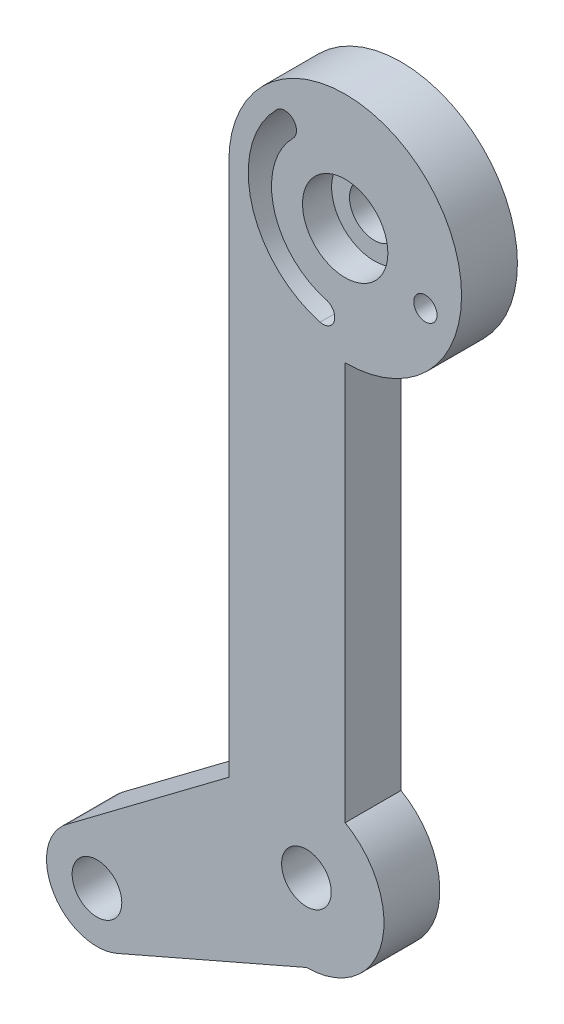
ISO-10303-21;
HEADER;
FILE_DESCRIPTION(('STEP AP214'),'2;1');
FILE_NAME('part.step','',(''),(''),'','','');
FILE_SCHEMA(('AUTOMOTIVE_DESIGN { 1 0 10303 214 1 1 1 1 }'));
ENDSEC;
DATA;
#1=APPLICATION_CONTEXT('core data for automotive mechanical design processes');
#2=APPLICATION_PROTOCOL_DEFINITION('international standard','automotive_design',2000,#1);
#3=PRODUCT_CONTEXT('',#1,'mechanical');
#4=PRODUCT('Part','Part','',(#3));
#5=PRODUCT_RELATED_PRODUCT_CATEGORY('part','',(#4));
#6=PRODUCT_DEFINITION_FORMATION('','',#4);
#7=PRODUCT_DEFINITION_CONTEXT('part definition',#1,'design');
#8=PRODUCT_DEFINITION('design','',#6,#7);
#9=PRODUCT_DEFINITION_SHAPE('','',#8);
#10=(LENGTH_UNIT() NAMED_UNIT(*) SI_UNIT(.MILLI.,.METRE.));
#11=(NAMED_UNIT(*) PLANE_ANGLE_UNIT() SI_UNIT($,.RADIAN.));
#12=(NAMED_UNIT(*) SI_UNIT($,.STERADIAN.) SOLID_ANGLE_UNIT());
#13=UNCERTAINTY_MEASURE_WITH_UNIT(LENGTH_MEASURE(1.E-05),#10,'distance_accuracy_value','');
#14=(GEOMETRIC_REPRESENTATION_CONTEXT(3) GLOBAL_UNCERTAINTY_ASSIGNED_CONTEXT((#13)) GLOBAL_UNIT_ASSIGNED_CONTEXT((#10,
#11,#12)) REPRESENTATION_CONTEXT('',''));
#15=CARTESIAN_POINT('',(0.,0.,0.));
#16=DIRECTION('',(0.,0.,1.));
#17=DIRECTION('',(1.,0.,0.));
#18=AXIS2_PLACEMENT_3D('',#15,#16,#17);
#19=CARTESIAN_POINT('',(2.5,37.5,3.6));
#20=DIRECTION('',(0.,0.,-1.));
#21=DIRECTION('',(-1.,0.,0.));
#22=AXIS2_PLACEMENT_3D('',#19,#20,#21);
#23=CYLINDRICAL_SURFACE('',#22,1.6);
#24=CARTESIAN_POINT('',(2.5,37.5,0.));
#25=DIRECTION('',(0.,0.,1.));
#26=DIRECTION('',(1.,0.,0.));
#27=AXIS2_PLACEMENT_3D('',#24,#25,#26);
#28=CIRCLE('',#27,1.6);
#29=CARTESIAN_POINT('',(4.09999999999999,37.5,0.));
#30=VERTEX_POINT('',#29);
#31=EDGE_CURVE('E177',#30,#30,#28,.T.);
#32=ORIENTED_EDGE('',*,*,#31,.F.);
#33=EDGE_LOOP('',(#32));
#34=FACE_BOUND('',#33,.T.);
#35=CARTESIAN_POINT('',(2.5,37.5,1.725));
#36=DIRECTION('',(0.,0.,1.));
#37=DIRECTION('',(1.,0.,0.));
#38=AXIS2_PLACEMENT_3D('',#35,#36,#37);
#39=CIRCLE('',#38,1.6);
#40=CARTESIAN_POINT('',(4.09999999999999,37.5,1.725));
#41=VERTEX_POINT('',#40);
#42=EDGE_CURVE('E49',#41,#41,#39,.T.);
#43=ORIENTED_EDGE('',*,*,#42,.T.);
#44=EDGE_LOOP('',(#43));
#45=FACE_BOUND('',#44,.T.);
#46=ADVANCED_FACE('F45',(#34,#45),#23,.F.);
#47=CARTESIAN_POINT('',(2.5,37.5,3.6));
#48=DIRECTION('',(0.,0.,1.));
#49=DIRECTION('',(1.,0.,0.));
#50=AXIS2_PLACEMENT_3D('',#47,#48,#49);
#51=PLANE('',#50);
#52=CARTESIAN_POINT('',(2.5,37.5,3.6));
#53=DIRECTION('',(0.,0.,1.));
#54=DIRECTION('',(1.,0.,0.));
#55=AXIS2_PLACEMENT_3D('',#52,#53,#54);
#56=CIRCLE('',#55,2.75);
#57=CARTESIAN_POINT('',(5.25,37.5,3.6));
#58=VERTEX_POINT('',#57);
#59=EDGE_CURVE('E158',#58,#58,#56,.T.);
#60=ORIENTED_EDGE('',*,*,#59,.F.);
#61=EDGE_LOOP('',(#60));
#62=FACE_BOUND('',#61,.T.);
#63=CARTESIAN_POINT('',(2.5,37.5,3.6));
#64=DIRECTION('',(0.,0.,1.));
#65=DIRECTION('',(1.,0.,0.));
#66=AXIS2_PLACEMENT_3D('',#63,#64,#65);
#67=CIRCLE('',#66,6.25);
#68=CARTESIAN_POINT('',(-1.91941738241593,41.9194173824159,3.6));
#69=VERTEX_POINT('',#68);
#70=CARTESIAN_POINT('',(0.882380968109289,31.4629635856933,3.6));
#71=VERTEX_POINT('',#70);
#72=EDGE_CURVE('E62',#69,#71,#67,.T.);
#73=ORIENTED_EDGE('',*,*,#72,.F.);
#74=CARTESIAN_POINT('',(-1.38908729652602,41.389087296526,3.6));
#75=DIRECTION('',(0.,0.,1.));
#76=DIRECTION('',(1.,0.,0.));
#77=AXIS2_PLACEMENT_3D('',#74,#75,#76);
#78=CIRCLE('',#77,0.749999999999998);
#79=CARTESIAN_POINT('',(-0.858757210636112,40.8587572106361,3.6));
#80=VERTEX_POINT('',#79);
#81=EDGE_CURVE('E151',#80,#69,#78,.T.);
#82=ORIENTED_EDGE('',*,*,#81,.F.);
#83=CARTESIAN_POINT('',(2.5,37.5,3.6));
#84=DIRECTION('',(0.,0.,-1.));
#85=DIRECTION('',(1.,0.,0.));
#86=AXIS2_PLACEMENT_3D('',#83,#84,#85);
#87=CIRCLE('',#86,4.75);
#88=CARTESIAN_POINT('',(1.27060953576306,32.9118523251269,3.6));
#89=VERTEX_POINT('',#88);
#90=EDGE_CURVE('E155',#89,#80,#87,.T.);
#91=ORIENTED_EDGE('',*,*,#90,.F.);
#92=CARTESIAN_POINT('',(1.07649525193617,32.1874079554101,3.6));
#93=DIRECTION('',(0.,0.,1.));
#94=DIRECTION('',(1.,0.,0.));
#95=AXIS2_PLACEMENT_3D('',#92,#93,#94);
#96=CIRCLE('',#95,0.749999999999997);
#97=EDGE_CURVE('E167',#71,#89,#96,.T.);
#98=ORIENTED_EDGE('',*,*,#97,.F.);
#99=EDGE_LOOP('',(#73,#82,#91,#98));
#100=FACE_BOUND('',#99,.T.);
#101=CARTESIAN_POINT('',(7.66830941432249,35.6188892117088,3.6));
#102=DIRECTION('',(0.,0.,1.));
#103=DIRECTION('',(1.,0.,0.));
#104=AXIS2_PLACEMENT_3D('',#101,#102,#103);
#105=CIRCLE('',#104,0.749999999999998);
#106=CARTESIAN_POINT('',(8.41830941432249,35.6188892117088,3.6));
#107=VERTEX_POINT('',#106);
#108=EDGE_CURVE('E186',#107,#107,#105,.T.);
#109=ORIENTED_EDGE('',*,*,#108,.F.);
#110=EDGE_LOOP('',(#109));
#111=FACE_BOUND('',#110,.T.);
#112=CARTESIAN_POINT('',(-13.5,-7.33557540571723,3.6));
#113=DIRECTION('',(0.,0.,1.));
#114=DIRECTION('',(1.,0.,0.));
#115=AXIS2_PLACEMENT_3D('',#112,#113,#114);
#116=CIRCLE('',#115,1.6);
#117=CARTESIAN_POINT('',(-11.9,-7.33557540571723,3.6));
#118=VERTEX_POINT('',#117);
#119=EDGE_CURVE('E194',#118,#118,#116,.T.);
#120=ORIENTED_EDGE('',*,*,#119,.F.);
#121=EDGE_LOOP('',(#120));
#122=FACE_BOUND('',#121,.T.);
#123=CARTESIAN_POINT('',(2.5,37.5,3.6));
#124=DIRECTION('',(0.,0.,1.));
#125=DIRECTION('',(1.,0.,0.));
#126=AXIS2_PLACEMENT_3D('',#123,#124,#125);
#127=CIRCLE('',#126,7.5);
#128=CARTESIAN_POINT('',(2.5,30.,3.6));
#129=VERTEX_POINT('',#128);
#130=CARTESIAN_POINT('',(-5.00000000000001,37.5,3.6));
#131=VERTEX_POINT('',#130);
#132=EDGE_CURVE('E210',#129,#131,#127,.T.);
#133=ORIENTED_EDGE('',*,*,#132,.T.);
#134=DIRECTION('',(0.,-1.,0.));
#135=VECTOR('',#134,1.);
#136=CARTESIAN_POINT('',(-5.00000000000001,37.5,3.6));
#137=LINE('',#136,#135);
#138=CARTESIAN_POINT('',(-5.,3.11740899144273,3.6));
#139=VERTEX_POINT('',#138);
#140=EDGE_CURVE('E214',#131,#139,#137,.T.);
#141=ORIENTED_EDGE('',*,*,#140,.T.);
#142=DIRECTION('',(-0.799431116467898,-0.600757763181542,0.));
#143=VECTOR('',#142,1.);
#144=CARTESIAN_POINT('',(-15.45246273034,-4.73742427719656,3.6));
#145=LINE('',#144,#143);
#146=CARTESIAN_POINT('',(-15.45246273034,-4.73742427719656,3.6));
#147=VERTEX_POINT('',#146);
#148=EDGE_CURVE('E218',#139,#147,#145,.T.);
#149=ORIENTED_EDGE('',*,*,#148,.T.);
#150=CARTESIAN_POINT('',(-13.5,-7.33557540571723,3.6));
#151=DIRECTION('',(0.,0.,1.));
#152=DIRECTION('',(1.,0.,0.));
#153=AXIS2_PLACEMENT_3D('',#150,#151,#152);
#154=CIRCLE('',#153,3.25);
#155=CARTESIAN_POINT('',(-12.2021064240457,-10.3151680398698,3.6));
#156=VERTEX_POINT('',#155);
#157=EDGE_CURVE('E221',#147,#156,#154,.T.);
#158=ORIENTED_EDGE('',*,*,#157,.T.);
#159=DIRECTION('',(0.916797733585422,0.399351869524401,0.));
#160=VECTOR('',#159,1.);
#161=CARTESIAN_POINT('',(-12.2021064240457,-10.3151680398698,3.6));
#162=LINE('',#161,#160);
#163=CARTESIAN_POINT('',(0.,-5.,3.6));
#164=VERTEX_POINT('',#163);
#165=EDGE_CURVE('E224',#156,#164,#162,.T.);
#166=ORIENTED_EDGE('',*,*,#165,.T.);
#167=CARTESIAN_POINT('',(0.,0.,3.6));
#168=DIRECTION('',(0.,0.,1.));
#169=DIRECTION('',(1.,0.,0.));
#170=AXIS2_PLACEMENT_3D('',#167,#168,#169);
#171=CIRCLE('',#170,5.);
#172=CARTESIAN_POINT('',(2.5,4.33012701892219,3.6));
#173=VERTEX_POINT('',#172);
#174=EDGE_CURVE('E227',#164,#173,#171,.T.);
#175=ORIENTED_EDGE('',*,*,#174,.T.);
#176=DIRECTION('',(0.,1.,0.));
#177=VECTOR('',#176,1.);
#178=CARTESIAN_POINT('',(2.5,30.,3.6));
#179=LINE('',#178,#177);
#180=EDGE_CURVE('E230',#173,#129,#179,.T.);
#181=ORIENTED_EDGE('',*,*,#180,.T.);
#182=EDGE_LOOP('',(#133,#141,#149,#158,#166,#175,#181));
#183=FACE_BOUND('',#182,.T.);
#184=CARTESIAN_POINT('',(0.,0.,3.6));
#185=DIRECTION('',(0.,0.,1.));
#186=DIRECTION('',(1.,0.,0.));
#187=AXIS2_PLACEMENT_3D('',#184,#185,#186);
#188=CIRCLE('',#187,1.6);
#189=CARTESIAN_POINT('',(1.6,0.,3.6));
#190=VERTEX_POINT('',#189);
#191=EDGE_CURVE('E202',#190,#190,#188,.T.);
#192=ORIENTED_EDGE('',*,*,#191,.F.);
#193=EDGE_LOOP('',(#192));
#194=FACE_BOUND('',#193,.T.);
#195=ADVANCED_FACE('F298',(#62,#100,#111,#122,#183,#194),#51,.T.);
#196=CARTESIAN_POINT('',(2.5,37.5,0.));
#197=DIRECTION('',(0.,0.,1.));
#198=DIRECTION('',(1.,0.,0.));
#199=AXIS2_PLACEMENT_3D('',#196,#197,#198);
#200=PLANE('',#199);
#201=CARTESIAN_POINT('',(-1.38908729652602,41.389087296526,0.));
#202=DIRECTION('',(0.,0.,1.));
#203=DIRECTION('',(1.,0.,0.));
#204=AXIS2_PLACEMENT_3D('',#201,#202,#203);
#205=CIRCLE('',#204,0.749999999999998);
#206=CARTESIAN_POINT('',(-0.858757210636112,40.8587572106361,0.));
#207=VERTEX_POINT('',#206);
#208=CARTESIAN_POINT('',(-1.91941738241593,41.9194173824159,0.));
#209=VERTEX_POINT('',#208);
#210=EDGE_CURVE('E139',#207,#209,#205,.T.);
#211=ORIENTED_EDGE('',*,*,#210,.T.);
#212=CARTESIAN_POINT('',(2.5,37.5,0.));
#213=DIRECTION('',(0.,0.,1.));
#214=DIRECTION('',(1.,0.,0.));
#215=AXIS2_PLACEMENT_3D('',#212,#213,#214);
#216=CIRCLE('',#215,6.25);
#217=CARTESIAN_POINT('',(0.882380968109287,31.4629635856933,0.));
#218=VERTEX_POINT('',#217);
#219=EDGE_CURVE('E132',#209,#218,#216,.T.);
#220=ORIENTED_EDGE('',*,*,#219,.T.);
#221=CARTESIAN_POINT('',(1.07649525193617,32.1874079554101,0.));
#222=DIRECTION('',(0.,0.,1.));
#223=DIRECTION('',(1.,0.,0.));
#224=AXIS2_PLACEMENT_3D('',#221,#222,#223);
#225=CIRCLE('',#224,0.749999999999997);
#226=CARTESIAN_POINT('',(1.27060953576306,32.9118523251269,0.));
#227=VERTEX_POINT('',#226);
#228=EDGE_CURVE('E142',#218,#227,#225,.T.);
#229=ORIENTED_EDGE('',*,*,#228,.T.);
#230=CARTESIAN_POINT('',(2.5,37.5,0.));
#231=DIRECTION('',(0.,0.,-1.));
#232=DIRECTION('',(1.,0.,0.));
#233=AXIS2_PLACEMENT_3D('',#230,#231,#232);
#234=CIRCLE('',#233,4.75);
#235=EDGE_CURVE('E70',#227,#207,#234,.T.);
#236=ORIENTED_EDGE('',*,*,#235,.T.);
#237=EDGE_LOOP('',(#211,#220,#229,#236));
#238=FACE_BOUND('',#237,.T.);
#239=CARTESIAN_POINT('',(7.66830941432249,35.6188892117088,0.));
#240=DIRECTION('',(0.,0.,1.));
#241=DIRECTION('',(1.,0.,0.));
#242=AXIS2_PLACEMENT_3D('',#239,#240,#241);
#243=CIRCLE('',#242,0.749999999999998);
#244=CARTESIAN_POINT('',(8.41830941432249,35.6188892117088,0.));
#245=VERTEX_POINT('',#244);
#246=EDGE_CURVE('E168',#245,#245,#243,.T.);
#247=ORIENTED_EDGE('',*,*,#246,.T.);
#248=EDGE_LOOP('',(#247));
#249=FACE_BOUND('',#248,.T.);
#250=CARTESIAN_POINT('',(2.5,37.5,0.));
#251=DIRECTION('',(0.,0.,1.));
#252=DIRECTION('',(1.,0.,0.));
#253=AXIS2_PLACEMENT_3D('',#250,#251,#252);
#254=CIRCLE('',#253,7.5);
#255=CARTESIAN_POINT('',(2.5,30.,0.));
#256=VERTEX_POINT('',#255);
#257=CARTESIAN_POINT('',(-5.00000000000001,37.5,0.));
#258=VERTEX_POINT('',#257);
#259=EDGE_CURVE('E206',#256,#258,#254,.T.);
#260=ORIENTED_EDGE('',*,*,#259,.F.);
#261=DIRECTION('',(0.,1.,0.));
#262=VECTOR('',#261,1.);
#263=CARTESIAN_POINT('',(2.5,30.,0.));
#264=LINE('',#263,#262);
#265=CARTESIAN_POINT('',(2.5,4.33012701892219,0.));
#266=VERTEX_POINT('',#265);
#267=EDGE_CURVE('E215',#266,#256,#264,.T.);
#268=ORIENTED_EDGE('',*,*,#267,.F.);
#269=CARTESIAN_POINT('',(0.,0.,0.));
#270=DIRECTION('',(0.,0.,1.));
#271=DIRECTION('',(1.,0.,0.));
#272=AXIS2_PLACEMENT_3D('',#269,#270,#271);
#273=CIRCLE('',#272,5.);
#274=CARTESIAN_POINT('',(0.,-5.,0.));
#275=VERTEX_POINT('',#274);
#276=EDGE_CURVE('E249',#275,#266,#273,.T.);
#277=ORIENTED_EDGE('',*,*,#276,.F.);
#278=DIRECTION('',(0.916797733585422,0.399351869524401,0.));
#279=VECTOR('',#278,1.);
#280=CARTESIAN_POINT('',(-12.2021064240457,-10.3151680398698,0.));
#281=LINE('',#280,#279);
#282=CARTESIAN_POINT('',(-12.2021064240457,-10.3151680398698,0.));
#283=VERTEX_POINT('',#282);
#284=EDGE_CURVE('E246',#283,#275,#281,.T.);
#285=ORIENTED_EDGE('',*,*,#284,.F.);
#286=CARTESIAN_POINT('',(-13.5,-7.33557540571723,0.));
#287=DIRECTION('',(0.,0.,1.));
#288=DIRECTION('',(1.,0.,0.));
#289=AXIS2_PLACEMENT_3D('',#286,#287,#288);
#290=CIRCLE('',#289,3.25);
#291=CARTESIAN_POINT('',(-15.45246273034,-4.73742427719656,0.));
#292=VERTEX_POINT('',#291);
#293=EDGE_CURVE('E243',#292,#283,#290,.T.);
#294=ORIENTED_EDGE('',*,*,#293,.F.);
#295=DIRECTION('',(-0.799431116467898,-0.600757763181542,0.));
#296=VECTOR('',#295,1.);
#297=CARTESIAN_POINT('',(-15.45246273034,-4.73742427719656,0.));
#298=LINE('',#297,#296);
#299=CARTESIAN_POINT('',(-5.,3.11740899144273,0.));
#300=VERTEX_POINT('',#299);
#301=EDGE_CURVE('E240',#300,#292,#298,.T.);
#302=ORIENTED_EDGE('',*,*,#301,.F.);
#303=DIRECTION('',(0.,-1.,0.));
#304=VECTOR('',#303,1.);
#305=CARTESIAN_POINT('',(-5.00000000000001,37.5,0.));
#306=LINE('',#305,#304);
#307=EDGE_CURVE('E237',#258,#300,#306,.T.);
#308=ORIENTED_EDGE('',*,*,#307,.F.);
#309=EDGE_LOOP('',(#260,#268,#277,#285,#294,#302,#308));
#310=FACE_BOUND('',#309,.T.);
#311=CARTESIAN_POINT('',(0.,0.,0.));
#312=DIRECTION('',(0.,0.,1.));
#313=DIRECTION('',(1.,0.,0.));
#314=AXIS2_PLACEMENT_3D('',#311,#312,#313);
#315=CIRCLE('',#314,1.6);
#316=CARTESIAN_POINT('',(1.6,0.,0.));
#317=VERTEX_POINT('',#316);
#318=EDGE_CURVE('E198',#317,#317,#315,.T.);
#319=ORIENTED_EDGE('',*,*,#318,.T.);
#320=EDGE_LOOP('',(#319));
#321=FACE_BOUND('',#320,.T.);
#322=CARTESIAN_POINT('',(-13.5,-7.33557540571723,0.));
#323=DIRECTION('',(0.,0.,1.));
#324=DIRECTION('',(1.,0.,0.));
#325=AXIS2_PLACEMENT_3D('',#322,#323,#324);
#326=CIRCLE('',#325,1.6);
#327=CARTESIAN_POINT('',(-11.9,-7.33557540571723,0.));
#328=VERTEX_POINT('',#327);
#329=EDGE_CURVE('E193',#328,#328,#326,.T.);
#330=ORIENTED_EDGE('',*,*,#329,.T.);
#331=EDGE_LOOP('',(#330));
#332=FACE_BOUND('',#331,.T.);
#333=ORIENTED_EDGE('',*,*,#31,.T.);
#334=EDGE_LOOP('',(#333));
#335=FACE_BOUND('',#334,.T.);
#336=ADVANCED_FACE('F147',(#238,#249,#310,#321,#332,#335),#200,.F.);
#337=CARTESIAN_POINT('',(2.5,37.5,3.6));
#338=DIRECTION('',(0.,0.,-1.));
#339=DIRECTION('',(-1.,0.,0.));
#340=AXIS2_PLACEMENT_3D('',#337,#338,#339);
#341=CYLINDRICAL_SURFACE('',#340,7.5);
#342=ORIENTED_EDGE('',*,*,#259,.T.);
#343=DIRECTION('',(0.,0.,-1.));
#344=VECTOR('',#343,1.);
#345=CARTESIAN_POINT('',(-5.00000000000001,37.5,3.6));
#346=LINE('',#345,#344);
#347=EDGE_CURVE('E11',#131,#258,#346,.T.);
#348=ORIENTED_EDGE('',*,*,#347,.F.);
#349=ORIENTED_EDGE('',*,*,#132,.F.);
#350=DIRECTION('',(0.,0.,-1.));
#351=VECTOR('',#350,1.);
#352=CARTESIAN_POINT('',(2.5,30.,3.6));
#353=LINE('',#352,#351);
#354=EDGE_CURVE('E233',#129,#256,#353,.T.);
#355=ORIENTED_EDGE('',*,*,#354,.T.);
#356=EDGE_LOOP('',(#342,#348,#349,#355));
#357=FACE_BOUND('',#356,.T.);
#358=ADVANCED_FACE('F47',(#357),#341,.T.);
#359=CARTESIAN_POINT('',(-5.00000000000001,37.5,3.6));
#360=DIRECTION('',(1.,0.,0.));
#361=DIRECTION('',(0.,1.,0.));
#362=AXIS2_PLACEMENT_3D('',#359,#360,#361);
#363=PLANE('',#362);
#364=ORIENTED_EDGE('',*,*,#307,.T.);
#365=DIRECTION('',(0.,0.,-1.));
#366=VECTOR('',#365,1.);
#367=CARTESIAN_POINT('',(-5.,3.11740899144273,3.6));
#368=LINE('',#367,#366);
#369=EDGE_CURVE('E55',#139,#300,#368,.T.);
#370=ORIENTED_EDGE('',*,*,#369,.F.);
#371=ORIENTED_EDGE('',*,*,#140,.F.);
#372=ORIENTED_EDGE('',*,*,#347,.T.);
#373=EDGE_LOOP('',(#364,#370,#371,#372));
#374=FACE_BOUND('',#373,.T.);
#375=ADVANCED_FACE('F303',(#374),#363,.F.);
#376=CARTESIAN_POINT('',(-15.45246273034,-4.73742427719656,3.6));
#377=DIRECTION('',(0.600757763181542,-0.799431116467898,0.));
#378=DIRECTION('',(0.799431116467898,0.600757763181542,0.));
#379=AXIS2_PLACEMENT_3D('',#376,#377,#378);
#380=PLANE('',#379);
#381=ORIENTED_EDGE('',*,*,#301,.T.);
#382=DIRECTION('',(0.,0.,-1.));
#383=VECTOR('',#382,1.);
#384=CARTESIAN_POINT('',(-15.45246273034,-4.73742427719656,3.6));
#385=LINE('',#384,#383);
#386=EDGE_CURVE('E269',#147,#292,#385,.T.);
#387=ORIENTED_EDGE('',*,*,#386,.F.);
#388=ORIENTED_EDGE('',*,*,#148,.F.);
#389=ORIENTED_EDGE('',*,*,#369,.T.);
#390=EDGE_LOOP('',(#381,#387,#388,#389));
#391=FACE_BOUND('',#390,.T.);
#392=ADVANCED_FACE('F279',(#391),#380,.F.);
#393=CARTESIAN_POINT('',(-13.5,-7.33557540571723,3.6));
#394=DIRECTION('',(0.,0.,-1.));
#395=DIRECTION('',(-1.,0.,0.));
#396=AXIS2_PLACEMENT_3D('',#393,#394,#395);
#397=CYLINDRICAL_SURFACE('',#396,3.25);
#398=ORIENTED_EDGE('',*,*,#293,.T.);
#399=DIRECTION('',(0.,0.,-1.));
#400=VECTOR('',#399,1.);
#401=CARTESIAN_POINT('',(-12.2021064240457,-10.3151680398698,3.6));
#402=LINE('',#401,#400);
#403=EDGE_CURVE('E265',#156,#283,#402,.T.);
#404=ORIENTED_EDGE('',*,*,#403,.F.);
#405=ORIENTED_EDGE('',*,*,#157,.F.);
#406=ORIENTED_EDGE('',*,*,#386,.T.);
#407=EDGE_LOOP('',(#398,#404,#405,#406));
#408=FACE_BOUND('',#407,.T.);
#409=ADVANCED_FACE('F290',(#408),#397,.T.);
#410=CARTESIAN_POINT('',(-12.2021064240457,-10.3151680398698,3.6));
#411=DIRECTION('',(-0.3993518695244,0.916797733585422,0.));
#412=DIRECTION('',(-0.916797733585422,-0.399351869524401,0.));
#413=AXIS2_PLACEMENT_3D('',#410,#411,#412);
#414=PLANE('',#413);
#415=ORIENTED_EDGE('',*,*,#284,.T.);
#416=DIRECTION('',(0.,0.,-1.));
#417=VECTOR('',#416,1.);
#418=CARTESIAN_POINT('',(0.,-5.,3.6));
#419=LINE('',#418,#417);
#420=EDGE_CURVE('E261',#164,#275,#419,.T.);
#421=ORIENTED_EDGE('',*,*,#420,.F.);
#422=ORIENTED_EDGE('',*,*,#165,.F.);
#423=ORIENTED_EDGE('',*,*,#403,.T.);
#424=EDGE_LOOP('',(#415,#421,#422,#423));
#425=FACE_BOUND('',#424,.T.);
#426=ADVANCED_FACE('F294',(#425),#414,.F.);
#427=CARTESIAN_POINT('',(0.,0.,3.6));
#428=DIRECTION('',(0.,0.,-1.));
#429=DIRECTION('',(-1.,0.,0.));
#430=AXIS2_PLACEMENT_3D('',#427,#428,#429);
#431=CYLINDRICAL_SURFACE('',#430,5.);
#432=ORIENTED_EDGE('',*,*,#276,.T.);
#433=DIRECTION('',(0.,0.,-1.));
#434=VECTOR('',#433,1.);
#435=CARTESIAN_POINT('',(2.5,4.33012701892219,3.6));
#436=LINE('',#435,#434);
#437=EDGE_CURVE('E257',#173,#266,#436,.T.);
#438=ORIENTED_EDGE('',*,*,#437,.F.);
#439=ORIENTED_EDGE('',*,*,#174,.F.);
#440=ORIENTED_EDGE('',*,*,#420,.T.);
#441=EDGE_LOOP('',(#432,#438,#439,#440));
#442=FACE_BOUND('',#441,.T.);
#443=ADVANCED_FACE('F311',(#442),#431,.T.);
#444=CARTESIAN_POINT('',(2.5,30.,3.6));
#445=DIRECTION('',(-1.,0.,0.));
#446=DIRECTION('',(0.,-1.,0.));
#447=AXIS2_PLACEMENT_3D('',#444,#445,#446);
#448=PLANE('',#447);
#449=ORIENTED_EDGE('',*,*,#267,.T.);
#450=ORIENTED_EDGE('',*,*,#354,.F.);
#451=ORIENTED_EDGE('',*,*,#180,.F.);
#452=ORIENTED_EDGE('',*,*,#437,.T.);
#453=EDGE_LOOP('',(#449,#450,#451,#452));
#454=FACE_BOUND('',#453,.T.);
#455=ADVANCED_FACE('F308',(#454),#448,.F.);
#456=CARTESIAN_POINT('',(0.,0.,3.6));
#457=DIRECTION('',(0.,0.,-1.));
#458=DIRECTION('',(-1.,0.,0.));
#459=AXIS2_PLACEMENT_3D('',#456,#457,#458);
#460=CYLINDRICAL_SURFACE('',#459,1.6);
#461=ORIENTED_EDGE('',*,*,#191,.T.);
#462=EDGE_LOOP('',(#461));
#463=FACE_BOUND('',#462,.T.);
#464=ORIENTED_EDGE('',*,*,#318,.F.);
#465=EDGE_LOOP('',(#464));
#466=FACE_BOUND('',#465,.T.);
#467=ADVANCED_FACE('F318',(#463,#466),#460,.F.);
#468=CARTESIAN_POINT('',(-13.5,-7.33557540571723,3.6));
#469=DIRECTION('',(0.,0.,-1.));
#470=DIRECTION('',(-1.,0.,0.));
#471=AXIS2_PLACEMENT_3D('',#468,#469,#470);
#472=CYLINDRICAL_SURFACE('',#471,1.6);
#473=ORIENTED_EDGE('',*,*,#119,.T.);
#474=EDGE_LOOP('',(#473));
#475=FACE_BOUND('',#474,.T.);
#476=ORIENTED_EDGE('',*,*,#329,.F.);
#477=EDGE_LOOP('',(#476));
#478=FACE_BOUND('',#477,.T.);
#479=ADVANCED_FACE('F336',(#475,#478),#472,.F.);
#480=CARTESIAN_POINT('',(7.66830941432249,35.6188892117088,0.));
#481=DIRECTION('',(0.,0.,1.));
#482=DIRECTION('',(1.,0.,0.));
#483=AXIS2_PLACEMENT_3D('',#480,#481,#482);
#484=CYLINDRICAL_SURFACE('',#483,0.749999999999998);
#485=ORIENTED_EDGE('',*,*,#246,.F.);
#486=EDGE_LOOP('',(#485));
#487=FACE_BOUND('',#486,.T.);
#488=ORIENTED_EDGE('',*,*,#108,.T.);
#489=EDGE_LOOP('',(#488));
#490=FACE_BOUND('',#489,.T.);
#491=ADVANCED_FACE('F334',(#487,#490),#484,.F.);
#492=CARTESIAN_POINT('',(2.5,37.5,0.));
#493=DIRECTION('',(0.,0.,1.));
#494=DIRECTION('',(1.,0.,0.));
#495=AXIS2_PLACEMENT_3D('',#492,#493,#494);
#496=CYLINDRICAL_SURFACE('',#495,6.25);
#497=ORIENTED_EDGE('',*,*,#72,.T.);
#498=DIRECTION('',(0.,0.,1.));
#499=VECTOR('',#498,1.);
#500=CARTESIAN_POINT('',(0.882380968109287,31.4629635856933,0.));
#501=LINE('',#500,#499);
#502=EDGE_CURVE('E128',#218,#71,#501,.T.);
#503=ORIENTED_EDGE('',*,*,#502,.F.);
#504=ORIENTED_EDGE('',*,*,#219,.F.);
#505=DIRECTION('',(0.,0.,1.));
#506=VECTOR('',#505,1.);
#507=CARTESIAN_POINT('',(-1.91941738241593,41.9194173824159,0.));
#508=LINE('',#507,#506);
#509=EDGE_CURVE('E174',#209,#69,#508,.T.);
#510=ORIENTED_EDGE('',*,*,#509,.T.);
#511=EDGE_LOOP('',(#497,#503,#504,#510));
#512=FACE_BOUND('',#511,.T.);
#513=ADVANCED_FACE('F130',(#512),#496,.F.);
#514=CARTESIAN_POINT('',(-1.38908729652602,41.389087296526,0.));
#515=DIRECTION('',(0.,0.,1.));
#516=DIRECTION('',(1.,0.,0.));
#517=AXIS2_PLACEMENT_3D('',#514,#515,#516);
#518=CYLINDRICAL_SURFACE('',#517,0.749999999999998);
#519=ORIENTED_EDGE('',*,*,#81,.T.);
#520=ORIENTED_EDGE('',*,*,#509,.F.);
#521=ORIENTED_EDGE('',*,*,#210,.F.);
#522=DIRECTION('',(0.,0.,1.));
#523=VECTOR('',#522,1.);
#524=CARTESIAN_POINT('',(-0.858757210636112,40.8587572106361,0.));
#525=LINE('',#524,#523);
#526=EDGE_CURVE('E178',#207,#80,#525,.T.);
#527=ORIENTED_EDGE('',*,*,#526,.T.);
#528=EDGE_LOOP('',(#519,#520,#521,#527));
#529=FACE_BOUND('',#528,.T.);
#530=ADVANCED_FACE('F405',(#529),#518,.F.);
#531=CARTESIAN_POINT('',(2.5,37.5,0.));
#532=DIRECTION('',(0.,0.,1.));
#533=DIRECTION('',(1.,0.,0.));
#534=AXIS2_PLACEMENT_3D('',#531,#532,#533);
#535=CYLINDRICAL_SURFACE('',#534,4.75);
#536=ORIENTED_EDGE('',*,*,#90,.T.);
#537=ORIENTED_EDGE('',*,*,#526,.F.);
#538=ORIENTED_EDGE('',*,*,#235,.F.);
#539=DIRECTION('',(0.,0.,1.));
#540=VECTOR('',#539,1.);
#541=CARTESIAN_POINT('',(1.27060953576306,32.9118523251269,0.));
#542=LINE('',#541,#540);
#543=EDGE_CURVE('E138',#227,#89,#542,.T.);
#544=ORIENTED_EDGE('',*,*,#543,.T.);
#545=EDGE_LOOP('',(#536,#537,#538,#544));
#546=FACE_BOUND('',#545,.T.);
#547=ADVANCED_FACE('F413',(#546),#535,.T.);
#548=CARTESIAN_POINT('',(1.07649525193617,32.1874079554101,0.));
#549=DIRECTION('',(0.,0.,1.));
#550=DIRECTION('',(1.,0.,0.));
#551=AXIS2_PLACEMENT_3D('',#548,#549,#550);
#552=CYLINDRICAL_SURFACE('',#551,0.749999999999997);
#553=ORIENTED_EDGE('',*,*,#97,.T.);
#554=ORIENTED_EDGE('',*,*,#543,.F.);
#555=ORIENTED_EDGE('',*,*,#228,.F.);
#556=ORIENTED_EDGE('',*,*,#502,.T.);
#557=EDGE_LOOP('',(#553,#554,#555,#556));
#558=FACE_BOUND('',#557,.T.);
#559=ADVANCED_FACE('F143',(#558),#552,.F.);
#560=CARTESIAN_POINT('',(2.5,37.5,1.725));
#561=DIRECTION('',(0.,0.,1.));
#562=DIRECTION('',(1.,0.,0.));
#563=AXIS2_PLACEMENT_3D('',#560,#561,#562);
#564=CYLINDRICAL_SURFACE('',#563,2.75);
#565=CARTESIAN_POINT('',(2.5,37.5,1.725));
#566=DIRECTION('',(0.,0.,1.));
#567=DIRECTION('',(1.,0.,0.));
#568=AXIS2_PLACEMENT_3D('',#565,#566,#567);
#569=CIRCLE('',#568,2.75);
#570=CARTESIAN_POINT('',(5.25,37.5,1.725));
#571=VERTEX_POINT('',#570);
#572=EDGE_CURVE('E461',#571,#571,#569,.T.);
#573=ORIENTED_EDGE('',*,*,#572,.F.);
#574=EDGE_LOOP('',(#573));
#575=FACE_BOUND('',#574,.T.);
#576=ORIENTED_EDGE('',*,*,#59,.T.);
#577=EDGE_LOOP('',(#576));
#578=FACE_BOUND('',#577,.T.);
#579=ADVANCED_FACE('F430',(#575,#578),#564,.F.);
#580=CARTESIAN_POINT('',(2.5,37.5,1.725));
#581=DIRECTION('',(0.,0.,1.));
#582=DIRECTION('',(1.,0.,0.));
#583=AXIS2_PLACEMENT_3D('',#580,#581,#582);
#584=PLANE('',#583);
#585=ORIENTED_EDGE('',*,*,#42,.F.);
#586=EDGE_LOOP('',(#585));
#587=FACE_BOUND('',#586,.T.);
#588=ORIENTED_EDGE('',*,*,#572,.T.);
#589=EDGE_LOOP('',(#588));
#590=FACE_BOUND('',#589,.T.);
#591=ADVANCED_FACE('F443',(#587,#590),#584,.T.);
#592=CLOSED_SHELL('',(#46,#195,#336,#358,#375,#392,#409,#426,#443,#455,#467,#479,#491,#513,#530,
#547,#559,#579,#591));
#593=MANIFOLD_SOLID_BREP('B2',#592);
#594=ADVANCED_BREP_SHAPE_REPRESENTATION('',(#18,#593),#14);
#595=SHAPE_DEFINITION_REPRESENTATION(#9,#594);
ENDSEC;
END-ISO-10303-21;
